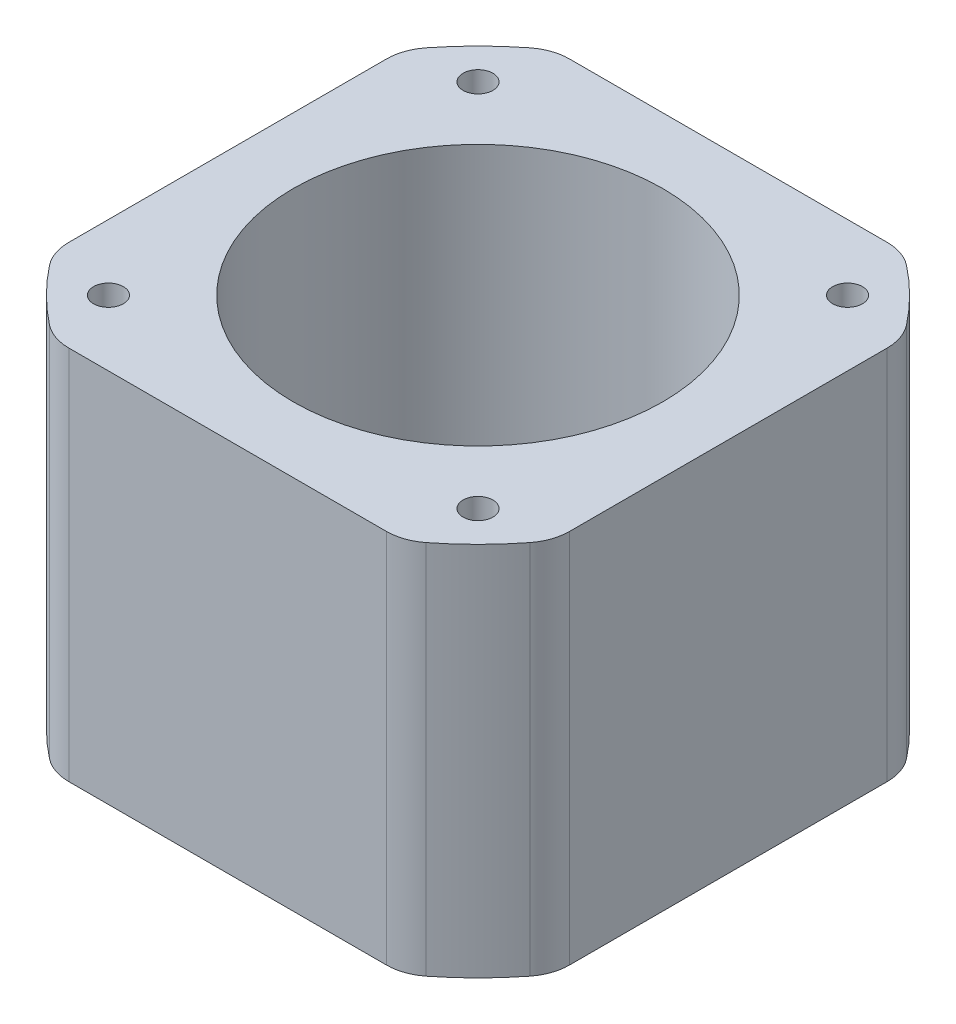
ISO-10303-21;
HEADER;
FILE_DESCRIPTION(('STEP AP214'),'2;1');
FILE_NAME('part.step','',(''),(''),'','','');
FILE_SCHEMA(('AUTOMOTIVE_DESIGN { 1 0 10303 214 1 1 1 1 }'));
ENDSEC;
DATA;
#1=APPLICATION_CONTEXT('core data for automotive mechanical design processes');
#2=APPLICATION_PROTOCOL_DEFINITION('international standard','automotive_design',2000,#1);
#3=PRODUCT_CONTEXT('',#1,'mechanical');
#4=PRODUCT('Part','Part','',(#3));
#5=PRODUCT_RELATED_PRODUCT_CATEGORY('part','',(#4));
#6=PRODUCT_DEFINITION_FORMATION('','',#4);
#7=PRODUCT_DEFINITION_CONTEXT('part definition',#1,'design');
#8=PRODUCT_DEFINITION('design','',#6,#7);
#9=PRODUCT_DEFINITION_SHAPE('','',#8);
#10=(LENGTH_UNIT() NAMED_UNIT(*) SI_UNIT(.MILLI.,.METRE.));
#11=(NAMED_UNIT(*) PLANE_ANGLE_UNIT() SI_UNIT($,.RADIAN.));
#12=(NAMED_UNIT(*) SI_UNIT($,.STERADIAN.) SOLID_ANGLE_UNIT());
#13=UNCERTAINTY_MEASURE_WITH_UNIT(LENGTH_MEASURE(1.E-05),#10,'distance_accuracy_value','');
#14=(GEOMETRIC_REPRESENTATION_CONTEXT(3) GLOBAL_UNCERTAINTY_ASSIGNED_CONTEXT((#13)) GLOBAL_UNIT_ASSIGNED_CONTEXT((#10,
#11,#12)) REPRESENTATION_CONTEXT('',''));
#15=CARTESIAN_POINT('',(0.,0.,0.));
#16=DIRECTION('',(0.,0.,1.));
#17=DIRECTION('',(1.,0.,0.));
#18=AXIS2_PLACEMENT_3D('',#15,#16,#17);
#19=CARTESIAN_POINT('',(0.,31.5,0.));
#20=DIRECTION('',(0.,1.,0.));
#21=DIRECTION('',(0.,0.,1.));
#22=AXIS2_PLACEMENT_3D('',#19,#20,#21);
#23=PLANE('',#22);
#24=CARTESIAN_POINT('',(15.5,31.5,15.5));
#25=DIRECTION('',(0.,1.,0.));
#26=DIRECTION('',(0.,0.,1.));
#27=AXIS2_PLACEMENT_3D('',#24,#25,#26);
#28=CIRCLE('',#27,1.25000000000001);
#29=CARTESIAN_POINT('',(15.5,31.5,16.75));
#30=VERTEX_POINT('',#29);
#31=EDGE_CURVE('E375',#30,#30,#28,.T.);
#32=ORIENTED_EDGE('',*,*,#31,.F.);
#33=EDGE_LOOP('',(#32));
#34=FACE_BOUND('',#33,.T.);
#35=CARTESIAN_POINT('',(-15.5,31.5,-15.5));
#36=DIRECTION('',(0.,1.,0.));
#37=DIRECTION('',(0.,0.,1.));
#38=AXIS2_PLACEMENT_3D('',#35,#36,#37);
#39=CIRCLE('',#38,1.25000000000001);
#40=CARTESIAN_POINT('',(-15.5,31.5,-14.25));
#41=VERTEX_POINT('',#40);
#42=EDGE_CURVE('E360',#41,#41,#39,.T.);
#43=ORIENTED_EDGE('',*,*,#42,.F.);
#44=EDGE_LOOP('',(#43));
#45=FACE_BOUND('',#44,.T.);
#46=CARTESIAN_POINT('',(0.,31.5,0.));
#47=DIRECTION('',(0.,1.,0.));
#48=DIRECTION('',(0.,0.,1.));
#49=AXIS2_PLACEMENT_3D('',#46,#47,#48);
#50=CIRCLE('',#49,25.6);
#51=CARTESIAN_POINT('',(-15.7927871574424,31.5,-20.1481481481481));
#52=VERTEX_POINT('',#51);
#53=CARTESIAN_POINT('',(-20.1481481481482,31.5,-15.7927871574423));
#54=VERTEX_POINT('',#53);
#55=EDGE_CURVE('E342',#52,#54,#50,.T.);
#56=ORIENTED_EDGE('',*,*,#55,.T.);
#57=CARTESIAN_POINT('',(-17.,31.5,-13.325164164092));
#58=DIRECTION('',(0.,1.,0.));
#59=DIRECTION('',(0.,0.,1.));
#60=AXIS2_PLACEMENT_3D('',#57,#58,#59);
#61=CIRCLE('',#60,4.);
#62=CARTESIAN_POINT('',(-21.,31.5,-13.325164164092));
#63=VERTEX_POINT('',#62);
#64=EDGE_CURVE('E252',#54,#63,#61,.T.);
#65=ORIENTED_EDGE('',*,*,#64,.T.);
#66=DIRECTION('',(0.,0.,1.));
#67=VECTOR('',#66,1.);
#68=CARTESIAN_POINT('',(-21.,31.5,14.641038214553));
#69=LINE('',#68,#67);
#70=CARTESIAN_POINT('',(-21.,31.5,13.325164164092));
#71=VERTEX_POINT('',#70);
#72=EDGE_CURVE('E172',#63,#71,#69,.T.);
#73=ORIENTED_EDGE('',*,*,#72,.T.);
#74=CARTESIAN_POINT('',(-17.,31.5,13.325164164092));
#75=DIRECTION('',(0.,1.,0.));
#76=DIRECTION('',(0.,0.,1.));
#77=AXIS2_PLACEMENT_3D('',#74,#75,#76);
#78=CIRCLE('',#77,4.);
#79=CARTESIAN_POINT('',(-20.1481481481482,31.5,15.7927871574423));
#80=VERTEX_POINT('',#79);
#81=EDGE_CURVE('E232',#71,#80,#78,.T.);
#82=ORIENTED_EDGE('',*,*,#81,.T.);
#83=CARTESIAN_POINT('',(0.,31.5,0.));
#84=DIRECTION('',(0.,1.,0.));
#85=DIRECTION('',(0.,0.,1.));
#86=AXIS2_PLACEMENT_3D('',#83,#84,#85);
#87=CIRCLE('',#86,25.6);
#88=CARTESIAN_POINT('',(-15.7927871574423,31.5,20.1481481481482));
#89=VERTEX_POINT('',#88);
#90=EDGE_CURVE('E297',#80,#89,#87,.T.);
#91=ORIENTED_EDGE('',*,*,#90,.T.);
#92=CARTESIAN_POINT('',(-13.325164164092,31.5,17.));
#93=DIRECTION('',(0.,1.,0.));
#94=DIRECTION('',(0.,0.,1.));
#95=AXIS2_PLACEMENT_3D('',#92,#93,#94);
#96=CIRCLE('',#95,4.);
#97=CARTESIAN_POINT('',(-13.325164164092,31.5,21.));
#98=VERTEX_POINT('',#97);
#99=EDGE_CURVE('E235',#89,#98,#96,.T.);
#100=ORIENTED_EDGE('',*,*,#99,.T.);
#101=DIRECTION('',(1.,0.,0.));
#102=VECTOR('',#101,1.);
#103=CARTESIAN_POINT('',(-14.641038214553,31.5,21.));
#104=LINE('',#103,#102);
#105=CARTESIAN_POINT('',(13.3251641640919,31.5,21.));
#106=VERTEX_POINT('',#105);
#107=EDGE_CURVE('E310',#98,#106,#104,.T.);
#108=ORIENTED_EDGE('',*,*,#107,.T.);
#109=CARTESIAN_POINT('',(13.3251641640919,31.5,17.));
#110=DIRECTION('',(0.,1.,0.));
#111=DIRECTION('',(0.,0.,1.));
#112=AXIS2_PLACEMENT_3D('',#109,#110,#111);
#113=CIRCLE('',#112,4.);
#114=CARTESIAN_POINT('',(15.7927871574423,31.5,20.1481481481482));
#115=VERTEX_POINT('',#114);
#116=EDGE_CURVE('E238',#106,#115,#113,.T.);
#117=ORIENTED_EDGE('',*,*,#116,.T.);
#118=CARTESIAN_POINT('',(0.,31.5,0.));
#119=DIRECTION('',(0.,1.,0.));
#120=DIRECTION('',(0.,0.,1.));
#121=AXIS2_PLACEMENT_3D('',#118,#119,#120);
#122=CIRCLE('',#121,25.6);
#123=CARTESIAN_POINT('',(20.1481481481481,31.5,15.7927871574423));
#124=VERTEX_POINT('',#123);
#125=EDGE_CURVE('E313',#115,#124,#122,.T.);
#126=ORIENTED_EDGE('',*,*,#125,.T.);
#127=CARTESIAN_POINT('',(17.,31.5,13.3251641640919));
#128=DIRECTION('',(0.,1.,0.));
#129=DIRECTION('',(0.,0.,1.));
#130=AXIS2_PLACEMENT_3D('',#127,#128,#129);
#131=CIRCLE('',#130,4.);
#132=CARTESIAN_POINT('',(21.,31.5,13.3251641640919));
#133=VERTEX_POINT('',#132);
#134=EDGE_CURVE('E59',#124,#133,#131,.T.);
#135=ORIENTED_EDGE('',*,*,#134,.T.);
#136=DIRECTION('',(0.,0.,-1.));
#137=VECTOR('',#136,1.);
#138=CARTESIAN_POINT('',(21.,31.5,14.641038214553));
#139=LINE('',#138,#137);
#140=CARTESIAN_POINT('',(21.,31.5,-13.3251641640919));
#141=VERTEX_POINT('',#140);
#142=EDGE_CURVE('E206',#133,#141,#139,.T.);
#143=ORIENTED_EDGE('',*,*,#142,.T.);
#144=CARTESIAN_POINT('',(17.,31.5,-13.3251641640919));
#145=DIRECTION('',(0.,1.,0.));
#146=DIRECTION('',(0.,0.,1.));
#147=AXIS2_PLACEMENT_3D('',#144,#145,#146);
#148=CIRCLE('',#147,4.);
#149=CARTESIAN_POINT('',(20.1481481481481,31.5,-15.7927871574423));
#150=VERTEX_POINT('',#149);
#151=EDGE_CURVE('E243',#141,#150,#148,.T.);
#152=ORIENTED_EDGE('',*,*,#151,.T.);
#153=CARTESIAN_POINT('',(0.,31.5,0.));
#154=DIRECTION('',(0.,1.,0.));
#155=DIRECTION('',(0.,0.,1.));
#156=AXIS2_PLACEMENT_3D('',#153,#154,#155);
#157=CIRCLE('',#156,25.6);
#158=CARTESIAN_POINT('',(15.7927871574423,31.5,-20.1481481481481));
#159=VERTEX_POINT('',#158);
#160=EDGE_CURVE('E204',#150,#159,#157,.T.);
#161=ORIENTED_EDGE('',*,*,#160,.T.);
#162=CARTESIAN_POINT('',(13.3251641640919,31.5,-17.));
#163=DIRECTION('',(0.,1.,0.));
#164=DIRECTION('',(0.,0.,1.));
#165=AXIS2_PLACEMENT_3D('',#162,#163,#164);
#166=CIRCLE('',#165,4.);
#167=CARTESIAN_POINT('',(13.3251641640919,31.5,-21.));
#168=VERTEX_POINT('',#167);
#169=EDGE_CURVE('E246',#159,#168,#166,.T.);
#170=ORIENTED_EDGE('',*,*,#169,.T.);
#171=DIRECTION('',(-1.,0.,0.));
#172=VECTOR('',#171,1.);
#173=CARTESIAN_POINT('',(-14.641038214553,31.5,-21.));
#174=LINE('',#173,#172);
#175=CARTESIAN_POINT('',(-13.325164164092,31.5,-21.));
#176=VERTEX_POINT('',#175);
#177=EDGE_CURVE('E343',#168,#176,#174,.T.);
#178=ORIENTED_EDGE('',*,*,#177,.T.);
#179=CARTESIAN_POINT('',(-13.325164164092,31.5,-17.));
#180=DIRECTION('',(0.,1.,0.));
#181=DIRECTION('',(0.,0.,1.));
#182=AXIS2_PLACEMENT_3D('',#179,#180,#181);
#183=CIRCLE('',#182,4.);
#184=EDGE_CURVE('E249',#176,#52,#183,.T.);
#185=ORIENTED_EDGE('',*,*,#184,.T.);
#186=EDGE_LOOP('',(#56,#65,#73,#82,#91,#100,#108,#117,#126,#135,#143,#152,#161,#170,#178,#185));
#187=FACE_BOUND('',#186,.T.);
#188=CARTESIAN_POINT('',(0.,31.5,0.));
#189=DIRECTION('',(0.,1.,0.));
#190=DIRECTION('',(0.,0.,1.));
#191=AXIS2_PLACEMENT_3D('',#188,#189,#190);
#192=CIRCLE('',#191,15.5);
#193=CARTESIAN_POINT('',(0.,31.5,15.5));
#194=VERTEX_POINT('',#193);
#195=EDGE_CURVE('E325',#194,#194,#192,.T.);
#196=ORIENTED_EDGE('',*,*,#195,.F.);
#197=EDGE_LOOP('',(#196));
#198=FACE_BOUND('',#197,.T.);
#199=CARTESIAN_POINT('',(15.5,31.5,-15.5));
#200=DIRECTION('',(0.,1.,0.));
#201=DIRECTION('',(0.,0.,1.));
#202=AXIS2_PLACEMENT_3D('',#199,#200,#201);
#203=CIRCLE('',#202,1.25000000000001);
#204=CARTESIAN_POINT('',(15.5,31.5,-14.25));
#205=VERTEX_POINT('',#204);
#206=EDGE_CURVE('E367',#205,#205,#203,.T.);
#207=ORIENTED_EDGE('',*,*,#206,.F.);
#208=EDGE_LOOP('',(#207));
#209=FACE_BOUND('',#208,.T.);
#210=CARTESIAN_POINT('',(-15.5,31.5,15.5));
#211=DIRECTION('',(0.,1.,0.));
#212=DIRECTION('',(0.,0.,1.));
#213=AXIS2_PLACEMENT_3D('',#210,#211,#212);
#214=CIRCLE('',#213,1.25000000000001);
#215=CARTESIAN_POINT('',(-15.5,31.5,16.75));
#216=VERTEX_POINT('',#215);
#217=EDGE_CURVE('E383',#216,#216,#214,.T.);
#218=ORIENTED_EDGE('',*,*,#217,.F.);
#219=EDGE_LOOP('',(#218));
#220=FACE_BOUND('',#219,.T.);
#221=ADVANCED_FACE('F36',(#34,#45,#187,#198,#209,#220),#23,.T.);
#222=CARTESIAN_POINT('',(0.,0.,0.));
#223=DIRECTION('',(0.,1.,0.));
#224=DIRECTION('',(0.,0.,1.));
#225=AXIS2_PLACEMENT_3D('',#222,#223,#224);
#226=PLANE('',#225);
#227=CARTESIAN_POINT('',(15.5,0.,15.5));
#228=DIRECTION('',(0.,1.,0.));
#229=DIRECTION('',(0.,0.,1.));
#230=AXIS2_PLACEMENT_3D('',#227,#228,#229);
#231=CIRCLE('',#230,1.25000000000001);
#232=CARTESIAN_POINT('',(15.5,0.,16.75));
#233=VERTEX_POINT('',#232);
#234=EDGE_CURVE('E379',#233,#233,#231,.T.);
#235=ORIENTED_EDGE('',*,*,#234,.T.);
#236=EDGE_LOOP('',(#235));
#237=FACE_BOUND('',#236,.T.);
#238=CARTESIAN_POINT('',(-15.5,0.,-15.5));
#239=DIRECTION('',(0.,1.,0.));
#240=DIRECTION('',(0.,0.,1.));
#241=AXIS2_PLACEMENT_3D('',#238,#239,#240);
#242=CIRCLE('',#241,1.25000000000001);
#243=CARTESIAN_POINT('',(-15.5,0.,-14.25));
#244=VERTEX_POINT('',#243);
#245=EDGE_CURVE('E364',#244,#244,#242,.T.);
#246=ORIENTED_EDGE('',*,*,#245,.T.);
#247=EDGE_LOOP('',(#246));
#248=FACE_BOUND('',#247,.T.);
#249=DIRECTION('',(0.,0.,1.));
#250=VECTOR('',#249,1.);
#251=CARTESIAN_POINT('',(-21.,0.,14.641038214553));
#252=LINE('',#251,#250);
#253=CARTESIAN_POINT('',(-21.,0.,-13.325164164092));
#254=VERTEX_POINT('',#253);
#255=CARTESIAN_POINT('',(-21.,0.,13.325164164092));
#256=VERTEX_POINT('',#255);
#257=EDGE_CURVE('E169',#254,#256,#252,.T.);
#258=ORIENTED_EDGE('',*,*,#257,.F.);
#259=CARTESIAN_POINT('',(-17.,0.,-13.325164164092));
#260=DIRECTION('',(0.,1.,0.));
#261=DIRECTION('',(0.,0.,1.));
#262=AXIS2_PLACEMENT_3D('',#259,#260,#261);
#263=CIRCLE('',#262,4.);
#264=CARTESIAN_POINT('',(-20.1481481481482,0.,-15.7927871574423));
#265=VERTEX_POINT('',#264);
#266=EDGE_CURVE('E151',#254,#265,#263,.F.);
#267=ORIENTED_EDGE('',*,*,#266,.T.);
#268=CARTESIAN_POINT('',(0.,0.,0.));
#269=DIRECTION('',(0.,1.,0.));
#270=DIRECTION('',(0.,0.,1.));
#271=AXIS2_PLACEMENT_3D('',#268,#269,#270);
#272=CIRCLE('',#271,25.6);
#273=CARTESIAN_POINT('',(-15.7927871574424,0.,-20.1481481481481));
#274=VERTEX_POINT('',#273);
#275=EDGE_CURVE('E182',#274,#265,#272,.T.);
#276=ORIENTED_EDGE('',*,*,#275,.F.);
#277=CARTESIAN_POINT('',(-13.325164164092,0.,-17.));
#278=DIRECTION('',(0.,1.,0.));
#279=DIRECTION('',(0.,0.,1.));
#280=AXIS2_PLACEMENT_3D('',#277,#278,#279);
#281=CIRCLE('',#280,4.);
#282=CARTESIAN_POINT('',(-13.325164164092,0.,-21.));
#283=VERTEX_POINT('',#282);
#284=EDGE_CURVE('E163',#274,#283,#281,.F.);
#285=ORIENTED_EDGE('',*,*,#284,.T.);
#286=DIRECTION('',(-1.,0.,0.));
#287=VECTOR('',#286,1.);
#288=CARTESIAN_POINT('',(-14.641038214553,0.,-21.));
#289=LINE('',#288,#287);
#290=CARTESIAN_POINT('',(13.3251641640919,0.,-21.));
#291=VERTEX_POINT('',#290);
#292=EDGE_CURVE('E190',#291,#283,#289,.T.);
#293=ORIENTED_EDGE('',*,*,#292,.F.);
#294=CARTESIAN_POINT('',(13.3251641640919,0.,-17.));
#295=DIRECTION('',(0.,1.,0.));
#296=DIRECTION('',(0.,0.,1.));
#297=AXIS2_PLACEMENT_3D('',#294,#295,#296);
#298=CIRCLE('',#297,4.);
#299=CARTESIAN_POINT('',(15.7927871574423,0.,-20.1481481481481));
#300=VERTEX_POINT('',#299);
#301=EDGE_CURVE('E222',#291,#300,#298,.F.);
#302=ORIENTED_EDGE('',*,*,#301,.T.);
#303=CARTESIAN_POINT('',(0.,0.,0.));
#304=DIRECTION('',(0.,1.,0.));
#305=DIRECTION('',(0.,0.,1.));
#306=AXIS2_PLACEMENT_3D('',#303,#304,#305);
#307=CIRCLE('',#306,25.6);
#308=CARTESIAN_POINT('',(20.1481481481481,0.,-15.7927871574423));
#309=VERTEX_POINT('',#308);
#310=EDGE_CURVE('E322',#309,#300,#307,.T.);
#311=ORIENTED_EDGE('',*,*,#310,.F.);
#312=CARTESIAN_POINT('',(17.,0.,-13.3251641640919));
#313=DIRECTION('',(0.,1.,0.));
#314=DIRECTION('',(0.,0.,1.));
#315=AXIS2_PLACEMENT_3D('',#312,#313,#314);
#316=CIRCLE('',#315,4.);
#317=CARTESIAN_POINT('',(21.,0.,-13.3251641640919));
#318=VERTEX_POINT('',#317);
#319=EDGE_CURVE('E219',#309,#318,#316,.F.);
#320=ORIENTED_EDGE('',*,*,#319,.T.);
#321=DIRECTION('',(0.,0.,-1.));
#322=VECTOR('',#321,1.);
#323=CARTESIAN_POINT('',(21.,0.,14.641038214553));
#324=LINE('',#323,#322);
#325=CARTESIAN_POINT('',(21.,0.,13.3251641640919));
#326=VERTEX_POINT('',#325);
#327=EDGE_CURVE('E201',#326,#318,#324,.T.);
#328=ORIENTED_EDGE('',*,*,#327,.F.);
#329=CARTESIAN_POINT('',(17.,0.,13.3251641640919));
#330=DIRECTION('',(0.,1.,0.));
#331=DIRECTION('',(0.,0.,1.));
#332=AXIS2_PLACEMENT_3D('',#329,#330,#331);
#333=CIRCLE('',#332,4.);
#334=CARTESIAN_POINT('',(20.1481481481481,0.,15.7927871574423));
#335=VERTEX_POINT('',#334);
#336=EDGE_CURVE('E216',#326,#335,#333,.F.);
#337=ORIENTED_EDGE('',*,*,#336,.T.);
#338=CARTESIAN_POINT('',(0.,0.,0.));
#339=DIRECTION('',(0.,1.,0.));
#340=DIRECTION('',(0.,0.,1.));
#341=AXIS2_PLACEMENT_3D('',#338,#339,#340);
#342=CIRCLE('',#341,25.6);
#343=CARTESIAN_POINT('',(15.7927871574423,0.,20.1481481481482));
#344=VERTEX_POINT('',#343);
#345=EDGE_CURVE('E197',#344,#335,#342,.T.);
#346=ORIENTED_EDGE('',*,*,#345,.F.);
#347=CARTESIAN_POINT('',(13.3251641640919,0.,17.));
#348=DIRECTION('',(0.,1.,0.));
#349=DIRECTION('',(0.,0.,1.));
#350=AXIS2_PLACEMENT_3D('',#347,#348,#349);
#351=CIRCLE('',#350,4.);
#352=CARTESIAN_POINT('',(13.3251641640919,0.,21.));
#353=VERTEX_POINT('',#352);
#354=EDGE_CURVE('E213',#344,#353,#351,.F.);
#355=ORIENTED_EDGE('',*,*,#354,.T.);
#356=DIRECTION('',(1.,0.,0.));
#357=VECTOR('',#356,1.);
#358=CARTESIAN_POINT('',(-14.641038214553,0.,21.));
#359=LINE('',#358,#357);
#360=CARTESIAN_POINT('',(-13.325164164092,0.,21.));
#361=VERTEX_POINT('',#360);
#362=EDGE_CURVE('E187',#361,#353,#359,.T.);
#363=ORIENTED_EDGE('',*,*,#362,.F.);
#364=CARTESIAN_POINT('',(-13.325164164092,0.,17.));
#365=DIRECTION('',(0.,1.,0.));
#366=DIRECTION('',(0.,0.,1.));
#367=AXIS2_PLACEMENT_3D('',#364,#365,#366);
#368=CIRCLE('',#367,4.);
#369=CARTESIAN_POINT('',(-15.7927871574423,0.,20.1481481481482));
#370=VERTEX_POINT('',#369);
#371=EDGE_CURVE('E210',#361,#370,#368,.F.);
#372=ORIENTED_EDGE('',*,*,#371,.T.);
#373=CARTESIAN_POINT('',(0.,0.,0.));
#374=DIRECTION('',(0.,1.,0.));
#375=DIRECTION('',(0.,0.,1.));
#376=AXIS2_PLACEMENT_3D('',#373,#374,#375);
#377=CIRCLE('',#376,25.6);
#378=CARTESIAN_POINT('',(-20.1481481481482,0.,15.7927871574423));
#379=VERTEX_POINT('',#378);
#380=EDGE_CURVE('E181',#379,#370,#377,.T.);
#381=ORIENTED_EDGE('',*,*,#380,.F.);
#382=CARTESIAN_POINT('',(-17.,0.,13.325164164092));
#383=DIRECTION('',(0.,1.,0.));
#384=DIRECTION('',(0.,0.,1.));
#385=AXIS2_PLACEMENT_3D('',#382,#383,#384);
#386=CIRCLE('',#385,4.);
#387=EDGE_CURVE('E174',#379,#256,#386,.F.);
#388=ORIENTED_EDGE('',*,*,#387,.T.);
#389=EDGE_LOOP('',(#258,#267,#276,#285,#293,#302,#311,#320,#328,#337,#346,#355,#363,#372,#381,#388));
#390=FACE_BOUND('',#389,.T.);
#391=CARTESIAN_POINT('',(0.,0.,0.));
#392=DIRECTION('',(0.,1.,0.));
#393=DIRECTION('',(0.,0.,1.));
#394=AXIS2_PLACEMENT_3D('',#391,#392,#393);
#395=CIRCLE('',#394,15.5);
#396=CARTESIAN_POINT('',(0.,0.,15.5));
#397=VERTEX_POINT('',#396);
#398=EDGE_CURVE('E356',#397,#397,#395,.T.);
#399=ORIENTED_EDGE('',*,*,#398,.T.);
#400=EDGE_LOOP('',(#399));
#401=FACE_BOUND('',#400,.T.);
#402=CARTESIAN_POINT('',(15.5,0.,-15.5));
#403=DIRECTION('',(0.,1.,0.));
#404=DIRECTION('',(0.,0.,1.));
#405=AXIS2_PLACEMENT_3D('',#402,#403,#404);
#406=CIRCLE('',#405,1.25000000000001);
#407=CARTESIAN_POINT('',(15.5,0.,-14.25));
#408=VERTEX_POINT('',#407);
#409=EDGE_CURVE('E371',#408,#408,#406,.T.);
#410=ORIENTED_EDGE('',*,*,#409,.T.);
#411=EDGE_LOOP('',(#410));
#412=FACE_BOUND('',#411,.T.);
#413=CARTESIAN_POINT('',(-15.5,0.,15.5));
#414=DIRECTION('',(0.,1.,0.));
#415=DIRECTION('',(0.,0.,1.));
#416=AXIS2_PLACEMENT_3D('',#413,#414,#415);
#417=CIRCLE('',#416,1.25000000000001);
#418=CARTESIAN_POINT('',(-15.5,0.,16.75));
#419=VERTEX_POINT('',#418);
#420=EDGE_CURVE('E386',#419,#419,#417,.T.);
#421=ORIENTED_EDGE('',*,*,#420,.T.);
#422=EDGE_LOOP('',(#421));
#423=FACE_BOUND('',#422,.T.);
#424=ADVANCED_FACE('F177',(#237,#248,#390,#401,#412,#423),#226,.F.);
#425=CARTESIAN_POINT('',(0.,31.5,0.));
#426=DIRECTION('',(0.,-1.,0.));
#427=DIRECTION('',(0.,0.,-1.));
#428=AXIS2_PLACEMENT_3D('',#425,#426,#427);
#429=CYLINDRICAL_SURFACE('',#428,25.6);
#430=ORIENTED_EDGE('',*,*,#310,.T.);
#431=DIRECTION('',(0.,-1.,0.));
#432=VECTOR('',#431,1.);
#433=CARTESIAN_POINT('',(15.7927871574423,31.5,-20.1481481481482));
#434=LINE('',#433,#432);
#435=EDGE_CURVE('E266',#300,#159,#434,.F.);
#436=ORIENTED_EDGE('',*,*,#435,.T.);
#437=ORIENTED_EDGE('',*,*,#160,.F.);
#438=DIRECTION('',(0.,-1.,0.));
#439=VECTOR('',#438,1.);
#440=CARTESIAN_POINT('',(20.1481481481481,31.5,-15.7927871574423));
#441=LINE('',#440,#439);
#442=EDGE_CURVE('E262',#150,#309,#441,.T.);
#443=ORIENTED_EDGE('',*,*,#442,.T.);
#444=EDGE_LOOP('',(#430,#436,#437,#443));
#445=FACE_BOUND('',#444,.T.);
#446=ADVANCED_FACE('F403',(#445),#429,.T.);
#447=CARTESIAN_POINT('',(-14.641038214553,31.5,-21.));
#448=DIRECTION('',(0.,0.,1.));
#449=DIRECTION('',(1.,0.,0.));
#450=AXIS2_PLACEMENT_3D('',#447,#448,#449);
#451=PLANE('',#450);
#452=ORIENTED_EDGE('',*,*,#292,.T.);
#453=DIRECTION('',(0.,-1.,0.));
#454=VECTOR('',#453,1.);
#455=CARTESIAN_POINT('',(-13.325164164092,31.5,-21.));
#456=LINE('',#455,#454);
#457=EDGE_CURVE('E259',#283,#176,#456,.F.);
#458=ORIENTED_EDGE('',*,*,#457,.T.);
#459=ORIENTED_EDGE('',*,*,#177,.F.);
#460=DIRECTION('',(0.,-1.,0.));
#461=VECTOR('',#460,1.);
#462=CARTESIAN_POINT('',(13.3251641640919,31.5,-21.));
#463=LINE('',#462,#461);
#464=EDGE_CURVE('E255',#168,#291,#463,.T.);
#465=ORIENTED_EDGE('',*,*,#464,.T.);
#466=EDGE_LOOP('',(#452,#458,#459,#465));
#467=FACE_BOUND('',#466,.T.);
#468=ADVANCED_FACE('F331',(#467),#451,.F.);
#469=CARTESIAN_POINT('',(0.,31.5,0.));
#470=DIRECTION('',(0.,-1.,0.));
#471=DIRECTION('',(0.,0.,-1.));
#472=AXIS2_PLACEMENT_3D('',#469,#470,#471);
#473=CYLINDRICAL_SURFACE('',#472,25.6);
#474=ORIENTED_EDGE('',*,*,#275,.T.);
#475=DIRECTION('',(0.,-1.,0.));
#476=VECTOR('',#475,1.);
#477=CARTESIAN_POINT('',(-20.1481481481482,31.5,-15.7927871574423));
#478=LINE('',#477,#476);
#479=EDGE_CURVE('E156',#265,#54,#478,.F.);
#480=ORIENTED_EDGE('',*,*,#479,.T.);
#481=ORIENTED_EDGE('',*,*,#55,.F.);
#482=DIRECTION('',(0.,-1.,0.));
#483=VECTOR('',#482,1.);
#484=CARTESIAN_POINT('',(-15.7927871574424,31.5,-20.1481481481482));
#485=LINE('',#484,#483);
#486=EDGE_CURVE('E162',#52,#274,#485,.T.);
#487=ORIENTED_EDGE('',*,*,#486,.T.);
#488=EDGE_LOOP('',(#474,#480,#481,#487));
#489=FACE_BOUND('',#488,.T.);
#490=ADVANCED_FACE('F345',(#489),#473,.T.);
#491=CARTESIAN_POINT('',(-21.,31.5,14.641038214553));
#492=DIRECTION('',(1.,0.,0.));
#493=DIRECTION('',(0.,0.,-1.));
#494=AXIS2_PLACEMENT_3D('',#491,#492,#493);
#495=PLANE('',#494);
#496=ORIENTED_EDGE('',*,*,#72,.F.);
#497=DIRECTION('',(0.,-1.,0.));
#498=VECTOR('',#497,1.);
#499=CARTESIAN_POINT('',(-21.,31.5,-13.325164164092));
#500=LINE('',#499,#498);
#501=EDGE_CURVE('E155',#63,#254,#500,.T.);
#502=ORIENTED_EDGE('',*,*,#501,.T.);
#503=ORIENTED_EDGE('',*,*,#257,.T.);
#504=DIRECTION('',(0.,-1.,0.));
#505=VECTOR('',#504,1.);
#506=CARTESIAN_POINT('',(-21.,31.5,13.325164164092));
#507=LINE('',#506,#505);
#508=EDGE_CURVE('E175',#256,#71,#507,.F.);
#509=ORIENTED_EDGE('',*,*,#508,.T.);
#510=EDGE_LOOP('',(#496,#502,#503,#509));
#511=FACE_BOUND('',#510,.T.);
#512=ADVANCED_FACE('F168',(#511),#495,.F.);
#513=CARTESIAN_POINT('',(0.,31.5,0.));
#514=DIRECTION('',(0.,-1.,0.));
#515=DIRECTION('',(0.,0.,-1.));
#516=AXIS2_PLACEMENT_3D('',#513,#514,#515);
#517=CYLINDRICAL_SURFACE('',#516,25.6);
#518=ORIENTED_EDGE('',*,*,#380,.T.);
#519=DIRECTION('',(0.,-1.,0.));
#520=VECTOR('',#519,1.);
#521=CARTESIAN_POINT('',(-15.7927871574423,31.5,20.1481481481482));
#522=LINE('',#521,#520);
#523=EDGE_CURVE('E11',#370,#89,#522,.F.);
#524=ORIENTED_EDGE('',*,*,#523,.T.);
#525=ORIENTED_EDGE('',*,*,#90,.F.);
#526=DIRECTION('',(0.,-1.,0.));
#527=VECTOR('',#526,1.);
#528=CARTESIAN_POINT('',(-20.1481481481482,31.5,15.7927871574423));
#529=LINE('',#528,#527);
#530=EDGE_CURVE('E45',#80,#379,#529,.T.);
#531=ORIENTED_EDGE('',*,*,#530,.T.);
#532=EDGE_LOOP('',(#518,#524,#525,#531));
#533=FACE_BOUND('',#532,.T.);
#534=ADVANCED_FACE('F294',(#533),#517,.T.);
#535=CARTESIAN_POINT('',(-14.641038214553,31.5,21.));
#536=DIRECTION('',(0.,0.,-1.));
#537=DIRECTION('',(-1.,0.,0.));
#538=AXIS2_PLACEMENT_3D('',#535,#536,#537);
#539=PLANE('',#538);
#540=ORIENTED_EDGE('',*,*,#362,.T.);
#541=DIRECTION('',(0.,-1.,0.));
#542=VECTOR('',#541,1.);
#543=CARTESIAN_POINT('',(13.3251641640919,31.5,21.));
#544=LINE('',#543,#542);
#545=EDGE_CURVE('E286',#353,#106,#544,.F.);
#546=ORIENTED_EDGE('',*,*,#545,.T.);
#547=ORIENTED_EDGE('',*,*,#107,.F.);
#548=DIRECTION('',(0.,-1.,0.));
#549=VECTOR('',#548,1.);
#550=CARTESIAN_POINT('',(-13.325164164092,31.5,21.));
#551=LINE('',#550,#549);
#552=EDGE_CURVE('E282',#98,#361,#551,.T.);
#553=ORIENTED_EDGE('',*,*,#552,.T.);
#554=EDGE_LOOP('',(#540,#546,#547,#553));
#555=FACE_BOUND('',#554,.T.);
#556=ADVANCED_FACE('F307',(#555),#539,.F.);
#557=CARTESIAN_POINT('',(0.,31.5,0.));
#558=DIRECTION('',(0.,-1.,0.));
#559=DIRECTION('',(0.,0.,-1.));
#560=AXIS2_PLACEMENT_3D('',#557,#558,#559);
#561=CYLINDRICAL_SURFACE('',#560,25.6);
#562=ORIENTED_EDGE('',*,*,#345,.T.);
#563=DIRECTION('',(0.,-1.,0.));
#564=VECTOR('',#563,1.);
#565=CARTESIAN_POINT('',(20.1481481481481,31.5,15.7927871574423));
#566=LINE('',#565,#564);
#567=EDGE_CURVE('E279',#335,#124,#566,.F.);
#568=ORIENTED_EDGE('',*,*,#567,.T.);
#569=ORIENTED_EDGE('',*,*,#125,.F.);
#570=DIRECTION('',(0.,-1.,0.));
#571=VECTOR('',#570,1.);
#572=CARTESIAN_POINT('',(15.7927871574423,31.5,20.1481481481482));
#573=LINE('',#572,#571);
#574=EDGE_CURVE('E275',#115,#344,#573,.T.);
#575=ORIENTED_EDGE('',*,*,#574,.T.);
#576=EDGE_LOOP('',(#562,#568,#569,#575));
#577=FACE_BOUND('',#576,.T.);
#578=ADVANCED_FACE('F415',(#577),#561,.T.);
#579=CARTESIAN_POINT('',(21.,31.5,14.641038214553));
#580=DIRECTION('',(-1.,0.,0.));
#581=DIRECTION('',(0.,0.,1.));
#582=AXIS2_PLACEMENT_3D('',#579,#580,#581);
#583=PLANE('',#582);
#584=ORIENTED_EDGE('',*,*,#327,.T.);
#585=DIRECTION('',(0.,-1.,0.));
#586=VECTOR('',#585,1.);
#587=CARTESIAN_POINT('',(21.,31.5,-13.3251641640919));
#588=LINE('',#587,#586);
#589=EDGE_CURVE('E52',#318,#141,#588,.F.);
#590=ORIENTED_EDGE('',*,*,#589,.T.);
#591=ORIENTED_EDGE('',*,*,#142,.F.);
#592=DIRECTION('',(0.,-1.,0.));
#593=VECTOR('',#592,1.);
#594=CARTESIAN_POINT('',(21.,31.5,13.3251641640919));
#595=LINE('',#594,#593);
#596=EDGE_CURVE('E269',#133,#326,#595,.T.);
#597=ORIENTED_EDGE('',*,*,#596,.T.);
#598=EDGE_LOOP('',(#584,#590,#591,#597));
#599=FACE_BOUND('',#598,.T.);
#600=ADVANCED_FACE('F412',(#599),#583,.F.);
#601=CARTESIAN_POINT('',(0.,31.5,0.));
#602=DIRECTION('',(0.,-1.,0.));
#603=DIRECTION('',(0.,0.,-1.));
#604=AXIS2_PLACEMENT_3D('',#601,#602,#603);
#605=CYLINDRICAL_SURFACE('',#604,15.5);
#606=ORIENTED_EDGE('',*,*,#195,.T.);
#607=EDGE_LOOP('',(#606));
#608=FACE_BOUND('',#607,.T.);
#609=ORIENTED_EDGE('',*,*,#398,.F.);
#610=EDGE_LOOP('',(#609));
#611=FACE_BOUND('',#610,.T.);
#612=ADVANCED_FACE('F409',(#608,#611),#605,.F.);
#613=CARTESIAN_POINT('',(-15.5,31.5,-15.5));
#614=DIRECTION('',(0.,-1.,0.));
#615=DIRECTION('',(0.,0.,-1.));
#616=AXIS2_PLACEMENT_3D('',#613,#614,#615);
#617=CYLINDRICAL_SURFACE('',#616,1.25000000000001);
#618=ORIENTED_EDGE('',*,*,#42,.T.);
#619=EDGE_LOOP('',(#618));
#620=FACE_BOUND('',#619,.T.);
#621=ORIENTED_EDGE('',*,*,#245,.F.);
#622=EDGE_LOOP('',(#621));
#623=FACE_BOUND('',#622,.T.);
#624=ADVANCED_FACE('F585',(#620,#623),#617,.F.);
#625=CARTESIAN_POINT('',(15.5,31.5,-15.5));
#626=DIRECTION('',(0.,-1.,0.));
#627=DIRECTION('',(0.,0.,-1.));
#628=AXIS2_PLACEMENT_3D('',#625,#626,#627);
#629=CYLINDRICAL_SURFACE('',#628,1.25000000000001);
#630=ORIENTED_EDGE('',*,*,#206,.T.);
#631=EDGE_LOOP('',(#630));
#632=FACE_BOUND('',#631,.T.);
#633=ORIENTED_EDGE('',*,*,#409,.F.);
#634=EDGE_LOOP('',(#633));
#635=FACE_BOUND('',#634,.T.);
#636=ADVANCED_FACE('F575',(#632,#635),#629,.F.);
#637=CARTESIAN_POINT('',(15.5,31.5,15.5));
#638=DIRECTION('',(0.,-1.,0.));
#639=DIRECTION('',(0.,0.,-1.));
#640=AXIS2_PLACEMENT_3D('',#637,#638,#639);
#641=CYLINDRICAL_SURFACE('',#640,1.25000000000001);
#642=ORIENTED_EDGE('',*,*,#31,.T.);
#643=EDGE_LOOP('',(#642));
#644=FACE_BOUND('',#643,.T.);
#645=ORIENTED_EDGE('',*,*,#234,.F.);
#646=EDGE_LOOP('',(#645));
#647=FACE_BOUND('',#646,.T.);
#648=ADVANCED_FACE('F566',(#644,#647),#641,.F.);
#649=CARTESIAN_POINT('',(-15.5,31.5,15.5));
#650=DIRECTION('',(0.,-1.,0.));
#651=DIRECTION('',(0.,0.,-1.));
#652=AXIS2_PLACEMENT_3D('',#649,#650,#651);
#653=CYLINDRICAL_SURFACE('',#652,1.25000000000001);
#654=ORIENTED_EDGE('',*,*,#217,.T.);
#655=EDGE_LOOP('',(#654));
#656=FACE_BOUND('',#655,.T.);
#657=ORIENTED_EDGE('',*,*,#420,.F.);
#658=EDGE_LOOP('',(#657));
#659=FACE_BOUND('',#658,.T.);
#660=ADVANCED_FACE('F394',(#656,#659),#653,.F.);
#661=CARTESIAN_POINT('',(-17.,31.5,-13.325164164092));
#662=DIRECTION('',(0.,-1.,0.));
#663=DIRECTION('',(0.,0.,-1.));
#664=AXIS2_PLACEMENT_3D('',#661,#662,#663);
#665=CYLINDRICAL_SURFACE('',#664,4.);
#666=ORIENTED_EDGE('',*,*,#64,.F.);
#667=ORIENTED_EDGE('',*,*,#479,.F.);
#668=ORIENTED_EDGE('',*,*,#266,.F.);
#669=ORIENTED_EDGE('',*,*,#501,.F.);
#670=EDGE_LOOP('',(#666,#667,#668,#669));
#671=FACE_BOUND('',#670,.T.);
#672=ADVANCED_FACE('F154',(#671),#665,.T.);
#673=CARTESIAN_POINT('',(-13.325164164092,31.5,-17.));
#674=DIRECTION('',(0.,-1.,0.));
#675=DIRECTION('',(0.,0.,-1.));
#676=AXIS2_PLACEMENT_3D('',#673,#674,#675);
#677=CYLINDRICAL_SURFACE('',#676,4.);
#678=ORIENTED_EDGE('',*,*,#184,.F.);
#679=ORIENTED_EDGE('',*,*,#457,.F.);
#680=ORIENTED_EDGE('',*,*,#284,.F.);
#681=ORIENTED_EDGE('',*,*,#486,.F.);
#682=EDGE_LOOP('',(#678,#679,#680,#681));
#683=FACE_BOUND('',#682,.T.);
#684=ADVANCED_FACE('F337',(#683),#677,.T.);
#685=CARTESIAN_POINT('',(13.3251641640919,31.5,-17.));
#686=DIRECTION('',(0.,-1.,0.));
#687=DIRECTION('',(0.,0.,-1.));
#688=AXIS2_PLACEMENT_3D('',#685,#686,#687);
#689=CYLINDRICAL_SURFACE('',#688,4.);
#690=ORIENTED_EDGE('',*,*,#169,.F.);
#691=ORIENTED_EDGE('',*,*,#435,.F.);
#692=ORIENTED_EDGE('',*,*,#301,.F.);
#693=ORIENTED_EDGE('',*,*,#464,.F.);
#694=EDGE_LOOP('',(#690,#691,#692,#693));
#695=FACE_BOUND('',#694,.T.);
#696=ADVANCED_FACE('F436',(#695),#689,.T.);
#697=CARTESIAN_POINT('',(17.,31.5,-13.3251641640919));
#698=DIRECTION('',(0.,-1.,0.));
#699=DIRECTION('',(0.,0.,-1.));
#700=AXIS2_PLACEMENT_3D('',#697,#698,#699);
#701=CYLINDRICAL_SURFACE('',#700,4.);
#702=ORIENTED_EDGE('',*,*,#151,.F.);
#703=ORIENTED_EDGE('',*,*,#589,.F.);
#704=ORIENTED_EDGE('',*,*,#319,.F.);
#705=ORIENTED_EDGE('',*,*,#442,.F.);
#706=EDGE_LOOP('',(#702,#703,#704,#705));
#707=FACE_BOUND('',#706,.T.);
#708=ADVANCED_FACE('F439',(#707),#701,.T.);
#709=CARTESIAN_POINT('',(17.,31.5,13.3251641640919));
#710=DIRECTION('',(0.,-1.,0.));
#711=DIRECTION('',(0.,0.,-1.));
#712=AXIS2_PLACEMENT_3D('',#709,#710,#711);
#713=CYLINDRICAL_SURFACE('',#712,4.);
#714=ORIENTED_EDGE('',*,*,#134,.F.);
#715=ORIENTED_EDGE('',*,*,#567,.F.);
#716=ORIENTED_EDGE('',*,*,#336,.F.);
#717=ORIENTED_EDGE('',*,*,#596,.F.);
#718=EDGE_LOOP('',(#714,#715,#716,#717));
#719=FACE_BOUND('',#718,.T.);
#720=ADVANCED_FACE('F443',(#719),#713,.T.);
#721=CARTESIAN_POINT('',(13.3251641640919,31.5,17.));
#722=DIRECTION('',(0.,-1.,0.));
#723=DIRECTION('',(0.,0.,-1.));
#724=AXIS2_PLACEMENT_3D('',#721,#722,#723);
#725=CYLINDRICAL_SURFACE('',#724,4.);
#726=ORIENTED_EDGE('',*,*,#116,.F.);
#727=ORIENTED_EDGE('',*,*,#545,.F.);
#728=ORIENTED_EDGE('',*,*,#354,.F.);
#729=ORIENTED_EDGE('',*,*,#574,.F.);
#730=EDGE_LOOP('',(#726,#727,#728,#729));
#731=FACE_BOUND('',#730,.T.);
#732=ADVANCED_FACE('F447',(#731),#725,.T.);
#733=CARTESIAN_POINT('',(-13.325164164092,31.5,17.));
#734=DIRECTION('',(0.,-1.,0.));
#735=DIRECTION('',(0.,0.,-1.));
#736=AXIS2_PLACEMENT_3D('',#733,#734,#735);
#737=CYLINDRICAL_SURFACE('',#736,4.);
#738=ORIENTED_EDGE('',*,*,#99,.F.);
#739=ORIENTED_EDGE('',*,*,#523,.F.);
#740=ORIENTED_EDGE('',*,*,#371,.F.);
#741=ORIENTED_EDGE('',*,*,#552,.F.);
#742=EDGE_LOOP('',(#738,#739,#740,#741));
#743=FACE_BOUND('',#742,.T.);
#744=ADVANCED_FACE('F304',(#743),#737,.T.);
#745=CARTESIAN_POINT('',(-17.,31.5,13.325164164092));
#746=DIRECTION('',(0.,-1.,0.));
#747=DIRECTION('',(0.,0.,-1.));
#748=AXIS2_PLACEMENT_3D('',#745,#746,#747);
#749=CYLINDRICAL_SURFACE('',#748,4.);
#750=ORIENTED_EDGE('',*,*,#81,.F.);
#751=ORIENTED_EDGE('',*,*,#508,.F.);
#752=ORIENTED_EDGE('',*,*,#387,.F.);
#753=ORIENTED_EDGE('',*,*,#530,.F.);
#754=EDGE_LOOP('',(#750,#751,#752,#753));
#755=FACE_BOUND('',#754,.T.);
#756=ADVANCED_FACE('F38',(#755),#749,.T.);
#757=CLOSED_SHELL('',(#221,#424,#446,#468,#490,#512,#534,#556,#578,#600,#612,#624,#636,#648,
#660,#672,#684,#696,#708,#720,#732,#744,#756));
#758=MANIFOLD_SOLID_BREP('B2',#757);
#759=ADVANCED_BREP_SHAPE_REPRESENTATION('',(#18,#758),#14);
#760=SHAPE_DEFINITION_REPRESENTATION(#9,#759);
ENDSEC;
END-ISO-10303-21;
